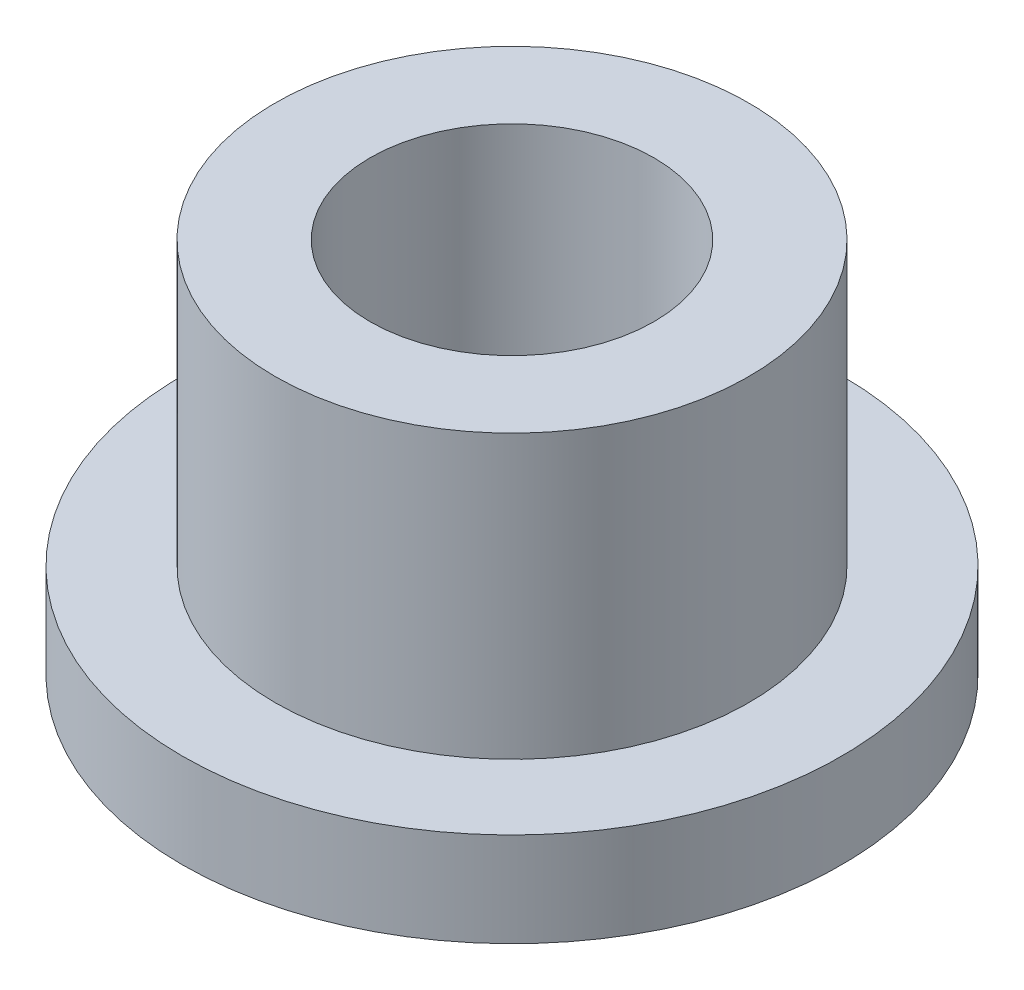
ISO-10303-21;
HEADER;
FILE_DESCRIPTION(('STEP AP214'),'2;1');
FILE_NAME('part.step','',(''),(''),'','','');
FILE_SCHEMA(('AUTOMOTIVE_DESIGN { 1 0 10303 214 1 1 1 1 }'));
ENDSEC;
DATA;
#1=APPLICATION_CONTEXT('core data for automotive mechanical design processes');
#2=APPLICATION_PROTOCOL_DEFINITION('international standard','automotive_design',2000,#1);
#3=PRODUCT_CONTEXT('',#1,'mechanical');
#4=PRODUCT('Part','Part','',(#3));
#5=PRODUCT_RELATED_PRODUCT_CATEGORY('part','',(#4));
#6=PRODUCT_DEFINITION_FORMATION('','',#4);
#7=PRODUCT_DEFINITION_CONTEXT('part definition',#1,'design');
#8=PRODUCT_DEFINITION('design','',#6,#7);
#9=PRODUCT_DEFINITION_SHAPE('','',#8);
#10=(LENGTH_UNIT() NAMED_UNIT(*) SI_UNIT(.MILLI.,.METRE.));
#11=(NAMED_UNIT(*) PLANE_ANGLE_UNIT() SI_UNIT($,.RADIAN.));
#12=(NAMED_UNIT(*) SI_UNIT($,.STERADIAN.) SOLID_ANGLE_UNIT());
#13=UNCERTAINTY_MEASURE_WITH_UNIT(LENGTH_MEASURE(1.E-05),#10,'distance_accuracy_value','');
#14=(GEOMETRIC_REPRESENTATION_CONTEXT(3) GLOBAL_UNCERTAINTY_ASSIGNED_CONTEXT((#13)) GLOBAL_UNIT_ASSIGNED_CONTEXT((#10,
#11,#12)) REPRESENTATION_CONTEXT('',''));
#15=CARTESIAN_POINT('',(0.,0.,0.));
#16=DIRECTION('',(0.,0.,1.));
#17=DIRECTION('',(1.,0.,0.));
#18=AXIS2_PLACEMENT_3D('',#15,#16,#17);
#19=CARTESIAN_POINT('',(0.,6.35,0.));
#20=DIRECTION('',(0.,1.,0.));
#21=DIRECTION('',(0.,0.,1.));
#22=AXIS2_PLACEMENT_3D('',#19,#20,#21);
#23=PLANE('',#22);
#24=CARTESIAN_POINT('',(0.,6.35,0.));
#25=DIRECTION('',(0.,1.,0.));
#26=DIRECTION('',(0.,0.,1.));
#27=AXIS2_PLACEMENT_3D('',#24,#25,#26);
#28=CIRCLE('',#27,3.99415);
#29=CARTESIAN_POINT('',(0.,6.35,3.99415));
#30=VERTEX_POINT('',#29);
#31=EDGE_CURVE('E10',#30,#30,#28,.T.);
#32=ORIENTED_EDGE('',*,*,#31,.T.);
#33=EDGE_LOOP('',(#32));
#34=FACE_BOUND('',#33,.T.);
#35=CARTESIAN_POINT('',(0.,6.35,0.));
#36=DIRECTION('',(0.,1.,0.));
#37=DIRECTION('',(0.,0.,1.));
#38=AXIS2_PLACEMENT_3D('',#35,#36,#37);
#39=CIRCLE('',#38,2.39395);
#40=CARTESIAN_POINT('',(0.,6.35,2.39395));
#41=VERTEX_POINT('',#40);
#42=EDGE_CURVE('E49',#41,#41,#39,.T.);
#43=ORIENTED_EDGE('',*,*,#42,.F.);
#44=EDGE_LOOP('',(#43));
#45=FACE_BOUND('',#44,.T.);
#46=ADVANCED_FACE('F41',(#34,#45),#23,.T.);
#47=CARTESIAN_POINT('',(0.,0.,0.));
#48=DIRECTION('',(0.,1.,0.));
#49=DIRECTION('',(0.,0.,1.));
#50=AXIS2_PLACEMENT_3D('',#47,#48,#49);
#51=PLANE('',#50);
#52=CARTESIAN_POINT('',(0.,0.,0.));
#53=DIRECTION('',(0.,1.,0.));
#54=DIRECTION('',(0.,0.,1.));
#55=AXIS2_PLACEMENT_3D('',#52,#53,#54);
#56=CIRCLE('',#55,2.39395);
#57=CARTESIAN_POINT('',(0.,0.,2.39395));
#58=VERTEX_POINT('',#57);
#59=EDGE_CURVE('E54',#58,#58,#56,.T.);
#60=ORIENTED_EDGE('',*,*,#59,.T.);
#61=EDGE_LOOP('',(#60));
#62=FACE_BOUND('',#61,.T.);
#63=CARTESIAN_POINT('',(0.,0.,0.));
#64=DIRECTION('',(0.,1.,0.));
#65=DIRECTION('',(0.,0.,1.));
#66=AXIS2_PLACEMENT_3D('',#63,#64,#65);
#67=CIRCLE('',#66,5.55625);
#68=CARTESIAN_POINT('',(0.,0.,5.55625));
#69=VERTEX_POINT('',#68);
#70=EDGE_CURVE('E62',#69,#69,#67,.T.);
#71=ORIENTED_EDGE('',*,*,#70,.F.);
#72=EDGE_LOOP('',(#71));
#73=FACE_BOUND('',#72,.T.);
#74=ADVANCED_FACE('F91',(#62,#73),#51,.F.);
#75=CARTESIAN_POINT('',(0.,6.35,0.));
#76=DIRECTION('',(0.,-1.,0.));
#77=DIRECTION('',(0.,0.,-1.));
#78=AXIS2_PLACEMENT_3D('',#75,#76,#77);
#79=CYLINDRICAL_SURFACE('',#78,3.99415);
#80=CARTESIAN_POINT('',(0.,1.5875,0.));
#81=DIRECTION('',(0.,1.,0.));
#82=DIRECTION('',(0.,0.,1.));
#83=AXIS2_PLACEMENT_3D('',#80,#81,#82);
#84=CIRCLE('',#83,3.99415);
#85=CARTESIAN_POINT('',(0.,1.5875,3.99415));
#86=VERTEX_POINT('',#85);
#87=EDGE_CURVE('E66',#86,#86,#84,.T.);
#88=ORIENTED_EDGE('',*,*,#87,.T.);
#89=EDGE_LOOP('',(#88));
#90=FACE_BOUND('',#89,.T.);
#91=ORIENTED_EDGE('',*,*,#31,.F.);
#92=EDGE_LOOP('',(#91));
#93=FACE_BOUND('',#92,.T.);
#94=ADVANCED_FACE('F43',(#90,#93),#79,.T.);
#95=CARTESIAN_POINT('',(0.,6.35,0.));
#96=DIRECTION('',(0.,-1.,0.));
#97=DIRECTION('',(0.,0.,-1.));
#98=AXIS2_PLACEMENT_3D('',#95,#96,#97);
#99=CYLINDRICAL_SURFACE('',#98,2.39395);
#100=ORIENTED_EDGE('',*,*,#42,.T.);
#101=EDGE_LOOP('',(#100));
#102=FACE_BOUND('',#101,.T.);
#103=ORIENTED_EDGE('',*,*,#59,.F.);
#104=EDGE_LOOP('',(#103));
#105=FACE_BOUND('',#104,.T.);
#106=ADVANCED_FACE('F79',(#102,#105),#99,.F.);
#107=CARTESIAN_POINT('',(0.,1.5875,0.));
#108=DIRECTION('',(0.,1.,0.));
#109=DIRECTION('',(0.,0.,1.));
#110=AXIS2_PLACEMENT_3D('',#107,#108,#109);
#111=PLANE('',#110);
#112=CARTESIAN_POINT('',(0.,1.5875,0.));
#113=DIRECTION('',(0.,1.,0.));
#114=DIRECTION('',(0.,0.,1.));
#115=AXIS2_PLACEMENT_3D('',#112,#113,#114);
#116=CIRCLE('',#115,5.55625);
#117=CARTESIAN_POINT('',(0.,1.5875,5.55625));
#118=VERTEX_POINT('',#117);
#119=EDGE_CURVE('E60',#118,#118,#116,.T.);
#120=ORIENTED_EDGE('',*,*,#119,.T.);
#121=EDGE_LOOP('',(#120));
#122=FACE_BOUND('',#121,.T.);
#123=ORIENTED_EDGE('',*,*,#87,.F.);
#124=EDGE_LOOP('',(#123));
#125=FACE_BOUND('',#124,.T.);
#126=ADVANCED_FACE('F76',(#122,#125),#111,.T.);
#127=CARTESIAN_POINT('',(0.,1.5875,0.));
#128=DIRECTION('',(0.,-1.,0.));
#129=DIRECTION('',(0.,0.,-1.));
#130=AXIS2_PLACEMENT_3D('',#127,#128,#129);
#131=CYLINDRICAL_SURFACE('',#130,5.55625);
#132=ORIENTED_EDGE('',*,*,#119,.F.);
#133=EDGE_LOOP('',(#132));
#134=FACE_BOUND('',#133,.T.);
#135=ORIENTED_EDGE('',*,*,#70,.T.);
#136=EDGE_LOOP('',(#135));
#137=FACE_BOUND('',#136,.T.);
#138=ADVANCED_FACE('F78',(#134,#137),#131,.T.);
#139=CLOSED_SHELL('',(#46,#74,#94,#106,#126,#138));
#140=MANIFOLD_SOLID_BREP('B2',#139);
#141=ADVANCED_BREP_SHAPE_REPRESENTATION('',(#18,#140),#14);
#142=SHAPE_DEFINITION_REPRESENTATION(#9,#141);
ENDSEC;
END-ISO-10303-21;
